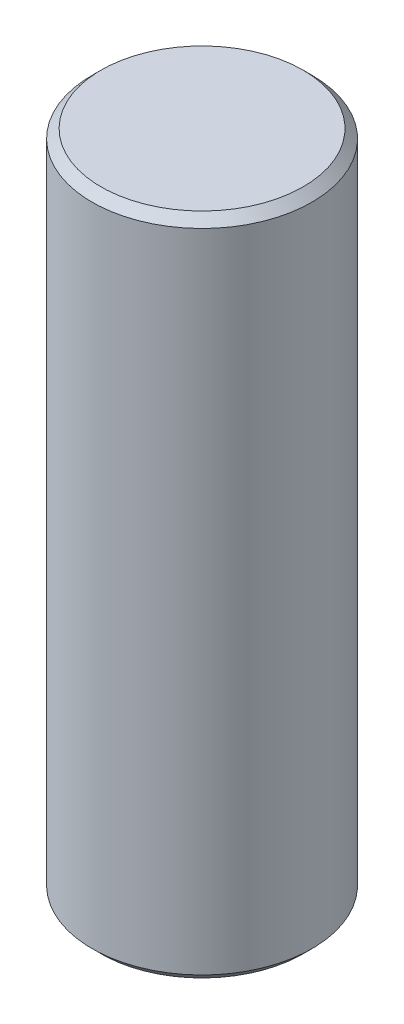
ISO-10303-21;
HEADER;
FILE_DESCRIPTION(('STEP AP214'),'2;1');
FILE_NAME('part.step','',(''),(''),'','','');
FILE_SCHEMA(('AUTOMOTIVE_DESIGN { 1 0 10303 214 1 1 1 1 }'));
ENDSEC;
DATA;
#1=APPLICATION_CONTEXT('core data for automotive mechanical design processes');
#2=APPLICATION_PROTOCOL_DEFINITION('international standard','automotive_design',2000,#1);
#3=PRODUCT_CONTEXT('',#1,'mechanical');
#4=PRODUCT('Part','Part','',(#3));
#5=PRODUCT_RELATED_PRODUCT_CATEGORY('part','',(#4));
#6=PRODUCT_DEFINITION_FORMATION('','',#4);
#7=PRODUCT_DEFINITION_CONTEXT('part definition',#1,'design');
#8=PRODUCT_DEFINITION('design','',#6,#7);
#9=PRODUCT_DEFINITION_SHAPE('','',#8);
#10=(LENGTH_UNIT() NAMED_UNIT(*) SI_UNIT(.MILLI.,.METRE.));
#11=(NAMED_UNIT(*) PLANE_ANGLE_UNIT() SI_UNIT($,.RADIAN.));
#12=(NAMED_UNIT(*) SI_UNIT($,.STERADIAN.) SOLID_ANGLE_UNIT());
#13=UNCERTAINTY_MEASURE_WITH_UNIT(LENGTH_MEASURE(1.E-05),#10,'distance_accuracy_value','');
#14=(GEOMETRIC_REPRESENTATION_CONTEXT(3) GLOBAL_UNCERTAINTY_ASSIGNED_CONTEXT((#13)) GLOBAL_UNIT_ASSIGNED_CONTEXT((#10,
#11,#12)) REPRESENTATION_CONTEXT('',''));
#15=CARTESIAN_POINT('',(0.,0.,0.));
#16=DIRECTION('',(0.,0.,1.));
#17=DIRECTION('',(1.,0.,0.));
#18=AXIS2_PLACEMENT_3D('',#15,#16,#17);
#19=CARTESIAN_POINT('',(0.,0.,0.));
#20=DIRECTION('',(0.,-1.,0.));
#21=DIRECTION('',(0.,0.,-1.));
#22=AXIS2_PLACEMENT_3D('',#19,#20,#21);
#23=CYLINDRICAL_SURFACE('',#22,4.7879);
#24=CARTESIAN_POINT('',(0.,0.,0.));
#25=DIRECTION('',(0.,-1.,0.));
#26=DIRECTION('',(0.,0.,-1.));
#27=AXIS2_PLACEMENT_3D('',#24,#25,#26);
#28=CIRCLE('',#27,4.7879);
#29=CARTESIAN_POINT('',(0.,0.,-4.7879));
#30=VERTEX_POINT('',#29);
#31=EDGE_CURVE('E10',#30,#30,#28,.T.);
#32=ORIENTED_EDGE('',*,*,#31,.T.);
#33=EDGE_LOOP('',(#32));
#34=FACE_BOUND('',#33,.T.);
#35=CARTESIAN_POINT('',(0.,2.032,0.));
#36=DIRECTION('',(0.,-1.,0.));
#37=DIRECTION('',(0.,0.,-1.));
#38=AXIS2_PLACEMENT_3D('',#35,#36,#37);
#39=CIRCLE('',#38,4.7879);
#40=CARTESIAN_POINT('',(0.,2.032,-4.7879));
#41=VERTEX_POINT('',#40);
#42=EDGE_CURVE('E55',#41,#41,#39,.T.);
#43=ORIENTED_EDGE('',*,*,#42,.F.);
#44=EDGE_LOOP('',(#43));
#45=FACE_BOUND('',#44,.T.);
#46=ADVANCED_FACE('F30',(#34,#45),#23,.F.);
#47=CARTESIAN_POINT('',(8.6995,0.,0.));
#48=DIRECTION('',(0.,-1.,0.));
#49=DIRECTION('',(0.,0.,-1.));
#50=AXIS2_PLACEMENT_3D('',#47,#48,#49);
#51=PLANE('',#50);
#52=CARTESIAN_POINT('',(0.,0.,0.));
#53=DIRECTION('',(0.,-1.,0.));
#54=DIRECTION('',(0.,0.,-1.));
#55=AXIS2_PLACEMENT_3D('',#52,#53,#54);
#56=CIRCLE('',#55,8.6995);
#57=CARTESIAN_POINT('',(0.,0.,-8.6995));
#58=VERTEX_POINT('',#57);
#59=EDGE_CURVE('E36',#58,#58,#56,.T.);
#60=ORIENTED_EDGE('',*,*,#59,.T.);
#61=EDGE_LOOP('',(#60));
#62=FACE_BOUND('',#61,.T.);
#63=ORIENTED_EDGE('',*,*,#31,.F.);
#64=EDGE_LOOP('',(#63));
#65=FACE_BOUND('',#64,.T.);
#66=ADVANCED_FACE('F63',(#62,#65),#51,.T.);
#67=CARTESIAN_POINT('',(0.,0.,0.));
#68=DIRECTION('',(0.,1.,0.));
#69=DIRECTION('',(0.,0.,1.));
#70=AXIS2_PLACEMENT_3D('',#67,#68,#69);
#71=CONICAL_SURFACE('',#70,8.6995,0.785398163397449);
#72=CARTESIAN_POINT('',(0.,0.762,0.));
#73=DIRECTION('',(0.,-1.,0.));
#74=DIRECTION('',(0.,0.,-1.));
#75=AXIS2_PLACEMENT_3D('',#72,#73,#74);
#76=CIRCLE('',#75,9.4615);
#77=CARTESIAN_POINT('',(0.,0.762,-9.4615));
#78=VERTEX_POINT('',#77);
#79=EDGE_CURVE('E40',#78,#78,#76,.T.);
#80=ORIENTED_EDGE('',*,*,#79,.T.);
#81=EDGE_LOOP('',(#80));
#82=FACE_BOUND('',#81,.T.);
#83=ORIENTED_EDGE('',*,*,#59,.F.);
#84=EDGE_LOOP('',(#83));
#85=FACE_BOUND('',#84,.T.);
#86=ADVANCED_FACE('F67',(#82,#85),#71,.T.);
#87=CARTESIAN_POINT('',(0.,0.,0.));
#88=DIRECTION('',(0.,-1.,0.));
#89=DIRECTION('',(0.,0.,-1.));
#90=AXIS2_PLACEMENT_3D('',#87,#88,#89);
#91=CYLINDRICAL_SURFACE('',#90,9.4615);
#92=CARTESIAN_POINT('',(0.,56.388,0.));
#93=DIRECTION('',(0.,-1.,0.));
#94=DIRECTION('',(0.,0.,-1.));
#95=AXIS2_PLACEMENT_3D('',#92,#93,#94);
#96=CIRCLE('',#95,9.4615);
#97=CARTESIAN_POINT('',(0.,56.388,-9.4615));
#98=VERTEX_POINT('',#97);
#99=EDGE_CURVE('E44',#98,#98,#96,.T.);
#100=ORIENTED_EDGE('',*,*,#99,.T.);
#101=EDGE_LOOP('',(#100));
#102=FACE_BOUND('',#101,.T.);
#103=ORIENTED_EDGE('',*,*,#79,.F.);
#104=EDGE_LOOP('',(#103));
#105=FACE_BOUND('',#104,.T.);
#106=ADVANCED_FACE('F71',(#102,#105),#91,.T.);
#107=CARTESIAN_POINT('',(0.,56.388,0.));
#108=DIRECTION('',(0.,-1.,0.));
#109=DIRECTION('',(0.,0.,-1.));
#110=AXIS2_PLACEMENT_3D('',#107,#108,#109);
#111=CONICAL_SURFACE('',#110,9.4615,0.78539816339745);
#112=CARTESIAN_POINT('',(0.,57.15,0.));
#113=DIRECTION('',(0.,-1.,0.));
#114=DIRECTION('',(0.,0.,-1.));
#115=AXIS2_PLACEMENT_3D('',#112,#113,#114);
#116=CIRCLE('',#115,8.6995);
#117=CARTESIAN_POINT('',(0.,57.15,-8.6995));
#118=VERTEX_POINT('',#117);
#119=EDGE_CURVE('E49',#118,#118,#116,.T.);
#120=ORIENTED_EDGE('',*,*,#119,.T.);
#121=EDGE_LOOP('',(#120));
#122=FACE_BOUND('',#121,.T.);
#123=ORIENTED_EDGE('',*,*,#99,.F.);
#124=EDGE_LOOP('',(#123));
#125=FACE_BOUND('',#124,.T.);
#126=ADVANCED_FACE('F78',(#122,#125),#111,.T.);
#127=CARTESIAN_POINT('',(8.6995,57.15,0.));
#128=DIRECTION('',(0.,1.,0.));
#129=DIRECTION('',(0.,0.,1.));
#130=AXIS2_PLACEMENT_3D('',#127,#128,#129);
#131=PLANE('',#130);
#132=ORIENTED_EDGE('',*,*,#119,.F.);
#133=EDGE_LOOP('',(#132));
#134=FACE_BOUND('',#133,.T.);
#135=ADVANCED_FACE('F82',(#134),#131,.T.);
#136=CARTESIAN_POINT('',(4.5339,2.286,0.));
#137=DIRECTION('',(0.,-1.,0.));
#138=DIRECTION('',(0.,0.,-1.));
#139=AXIS2_PLACEMENT_3D('',#136,#137,#138);
#140=PLANE('',#139);
#141=CARTESIAN_POINT('',(0.,2.286,0.));
#142=DIRECTION('',(0.,-1.,0.));
#143=DIRECTION('',(0.,0.,-1.));
#144=AXIS2_PLACEMENT_3D('',#141,#142,#143);
#145=CIRCLE('',#144,4.5339);
#146=CARTESIAN_POINT('',(0.,2.286,-4.5339));
#147=VERTEX_POINT('',#146);
#148=EDGE_CURVE('E52',#147,#147,#145,.T.);
#149=ORIENTED_EDGE('',*,*,#148,.T.);
#150=EDGE_LOOP('',(#149));
#151=FACE_BOUND('',#150,.T.);
#152=ADVANCED_FACE('F86',(#151),#140,.T.);
#153=CARTESIAN_POINT('',(0.,2.286,0.));
#154=DIRECTION('',(0.,-1.,0.));
#155=DIRECTION('',(0.,0.,-1.));
#156=AXIS2_PLACEMENT_3D('',#153,#154,#155);
#157=CONICAL_SURFACE('',#156,4.5339,0.785398163397448);
#158=ORIENTED_EDGE('',*,*,#42,.T.);
#159=EDGE_LOOP('',(#158));
#160=FACE_BOUND('',#159,.T.);
#161=ORIENTED_EDGE('',*,*,#148,.F.);
#162=EDGE_LOOP('',(#161));
#163=FACE_BOUND('',#162,.T.);
#164=ADVANCED_FACE('F59',(#160,#163),#157,.F.);
#165=CLOSED_SHELL('',(#46,#66,#86,#106,#126,#135,#152,#164));
#166=MANIFOLD_SOLID_BREP('B2',#165);
#167=ADVANCED_BREP_SHAPE_REPRESENTATION('',(#18,#166),#14);
#168=SHAPE_DEFINITION_REPRESENTATION(#9,#167);
ENDSEC;
END-ISO-10303-21;
